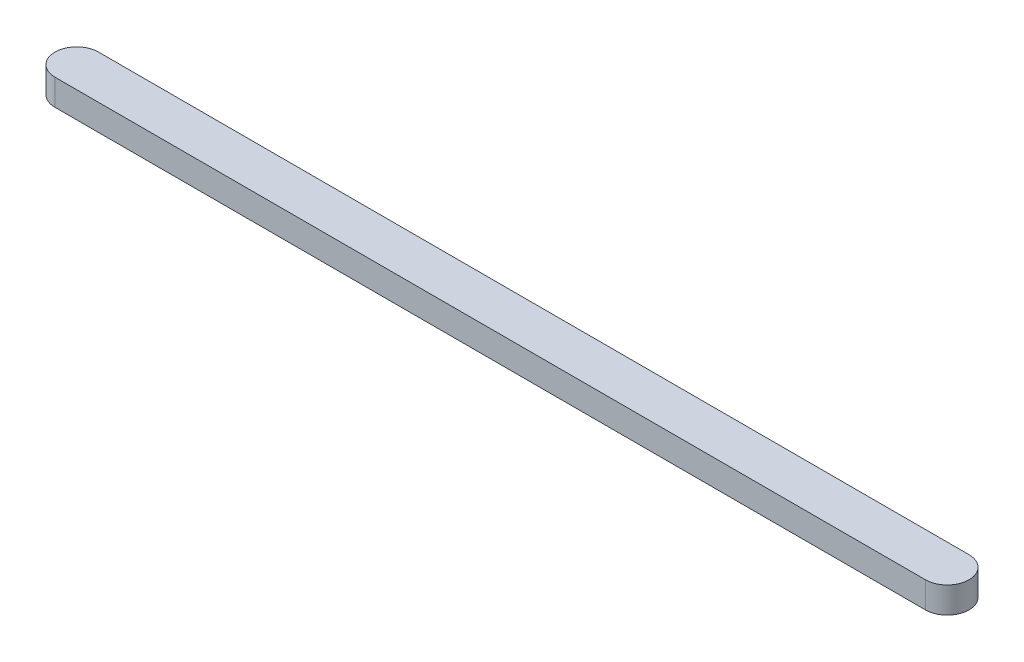
ISO-10303-21;
HEADER;
FILE_DESCRIPTION(('STEP AP214'),'2;1');
FILE_NAME('part.step','',(''),(''),'','','');
FILE_SCHEMA(('AUTOMOTIVE_DESIGN { 1 0 10303 214 1 1 1 1 }'));
ENDSEC;
DATA;
#1=APPLICATION_CONTEXT('core data for automotive mechanical design processes');
#2=APPLICATION_PROTOCOL_DEFINITION('international standard','automotive_design',2000,#1);
#3=PRODUCT_CONTEXT('',#1,'mechanical');
#4=PRODUCT('Part','Part','',(#3));
#5=PRODUCT_RELATED_PRODUCT_CATEGORY('part','',(#4));
#6=PRODUCT_DEFINITION_FORMATION('','',#4);
#7=PRODUCT_DEFINITION_CONTEXT('part definition',#1,'design');
#8=PRODUCT_DEFINITION('design','',#6,#7);
#9=PRODUCT_DEFINITION_SHAPE('','',#8);
#10=(LENGTH_UNIT() NAMED_UNIT(*) SI_UNIT(.MILLI.,.METRE.));
#11=(NAMED_UNIT(*) PLANE_ANGLE_UNIT() SI_UNIT($,.RADIAN.));
#12=(NAMED_UNIT(*) SI_UNIT($,.STERADIAN.) SOLID_ANGLE_UNIT());
#13=UNCERTAINTY_MEASURE_WITH_UNIT(LENGTH_MEASURE(1.E-05),#10,'distance_accuracy_value','');
#14=(GEOMETRIC_REPRESENTATION_CONTEXT(3) GLOBAL_UNCERTAINTY_ASSIGNED_CONTEXT((#13)) GLOBAL_UNIT_ASSIGNED_CONTEXT((#10,
#11,#12)) REPRESENTATION_CONTEXT('',''));
#15=CARTESIAN_POINT('',(0.,0.,0.));
#16=DIRECTION('',(0.,0.,1.));
#17=DIRECTION('',(1.,0.,0.));
#18=AXIS2_PLACEMENT_3D('',#15,#16,#17);
#19=CARTESIAN_POINT('',(0.,6.,0.));
#20=DIRECTION('',(0.,-1.,0.));
#21=DIRECTION('',(0.,0.,-1.));
#22=AXIS2_PLACEMENT_3D('',#19,#20,#21);
#23=CYLINDRICAL_SURFACE('',#22,5.);
#24=CARTESIAN_POINT('',(0.,0.,0.));
#25=DIRECTION('',(0.,1.,0.));
#26=DIRECTION('',(0.,0.,1.));
#27=AXIS2_PLACEMENT_3D('',#24,#25,#26);
#28=CIRCLE('',#27,5.);
#29=CARTESIAN_POINT('',(0.,0.,-5.));
#30=VERTEX_POINT('',#29);
#31=CARTESIAN_POINT('',(0.,0.,5.));
#32=VERTEX_POINT('',#31);
#33=EDGE_CURVE('E107',#30,#32,#28,.T.);
#34=ORIENTED_EDGE('',*,*,#33,.T.);
#35=DIRECTION('',(0.,-1.,0.));
#36=VECTOR('',#35,1.);
#37=CARTESIAN_POINT('',(0.,6.,5.));
#38=LINE('',#37,#36);
#39=CARTESIAN_POINT('',(0.,6.,5.));
#40=VERTEX_POINT('',#39);
#41=EDGE_CURVE('E11',#40,#32,#38,.T.);
#42=ORIENTED_EDGE('',*,*,#41,.F.);
#43=CARTESIAN_POINT('',(0.,6.,0.));
#44=DIRECTION('',(0.,1.,0.));
#45=DIRECTION('',(0.,0.,1.));
#46=AXIS2_PLACEMENT_3D('',#43,#44,#45);
#47=CIRCLE('',#46,5.);
#48=CARTESIAN_POINT('',(0.,6.,-5.));
#49=VERTEX_POINT('',#48);
#50=EDGE_CURVE('E91',#49,#40,#47,.T.);
#51=ORIENTED_EDGE('',*,*,#50,.F.);
#52=DIRECTION('',(0.,-1.,0.));
#53=VECTOR('',#52,1.);
#54=CARTESIAN_POINT('',(0.,6.,-5.));
#55=LINE('',#54,#53);
#56=EDGE_CURVE('E103',#49,#30,#55,.T.);
#57=ORIENTED_EDGE('',*,*,#56,.T.);
#58=EDGE_LOOP('',(#34,#42,#51,#57));
#59=FACE_BOUND('',#58,.T.);
#60=ADVANCED_FACE('F39',(#59),#23,.T.);
#61=CARTESIAN_POINT('',(0.,6.,5.));
#62=DIRECTION('',(0.,0.,-1.));
#63=DIRECTION('',(-1.,0.,0.));
#64=AXIS2_PLACEMENT_3D('',#61,#62,#63);
#65=PLANE('',#64);
#66=DIRECTION('',(1.,0.,0.));
#67=VECTOR('',#66,1.);
#68=CARTESIAN_POINT('',(0.,0.,5.));
#69=LINE('',#68,#67);
#70=CARTESIAN_POINT('',(200.,0.,5.));
#71=VERTEX_POINT('',#70);
#72=EDGE_CURVE('E96',#32,#71,#69,.T.);
#73=ORIENTED_EDGE('',*,*,#72,.T.);
#74=DIRECTION('',(0.,-1.,0.));
#75=VECTOR('',#74,1.);
#76=CARTESIAN_POINT('',(200.,6.,5.));
#77=LINE('',#76,#75);
#78=CARTESIAN_POINT('',(200.,6.,5.));
#79=VERTEX_POINT('',#78);
#80=EDGE_CURVE('E48',#79,#71,#77,.T.);
#81=ORIENTED_EDGE('',*,*,#80,.F.);
#82=DIRECTION('',(1.,0.,0.));
#83=VECTOR('',#82,1.);
#84=CARTESIAN_POINT('',(0.,6.,5.));
#85=LINE('',#84,#83);
#86=EDGE_CURVE('E86',#40,#79,#85,.T.);
#87=ORIENTED_EDGE('',*,*,#86,.F.);
#88=ORIENTED_EDGE('',*,*,#41,.T.);
#89=EDGE_LOOP('',(#73,#81,#87,#88));
#90=FACE_BOUND('',#89,.T.);
#91=ADVANCED_FACE('F95',(#90),#65,.F.);
#92=CARTESIAN_POINT('',(200.,6.,0.));
#93=DIRECTION('',(0.,-1.,0.));
#94=DIRECTION('',(0.,0.,-1.));
#95=AXIS2_PLACEMENT_3D('',#92,#93,#94);
#96=CYLINDRICAL_SURFACE('',#95,5.);
#97=CARTESIAN_POINT('',(200.,0.,0.));
#98=DIRECTION('',(0.,1.,0.));
#99=DIRECTION('',(0.,0.,1.));
#100=AXIS2_PLACEMENT_3D('',#97,#98,#99);
#101=CIRCLE('',#100,5.);
#102=CARTESIAN_POINT('',(200.,0.,-5.));
#103=VERTEX_POINT('',#102);
#104=EDGE_CURVE('E73',#71,#103,#101,.T.);
#105=ORIENTED_EDGE('',*,*,#104,.T.);
#106=DIRECTION('',(0.,-1.,0.));
#107=VECTOR('',#106,1.);
#108=CARTESIAN_POINT('',(200.,6.,-5.));
#109=LINE('',#108,#107);
#110=CARTESIAN_POINT('',(200.,6.,-5.));
#111=VERTEX_POINT('',#110);
#112=EDGE_CURVE('E98',#111,#103,#109,.T.);
#113=ORIENTED_EDGE('',*,*,#112,.F.);
#114=CARTESIAN_POINT('',(200.,6.,0.));
#115=DIRECTION('',(0.,1.,0.));
#116=DIRECTION('',(0.,0.,1.));
#117=AXIS2_PLACEMENT_3D('',#114,#115,#116);
#118=CIRCLE('',#117,5.);
#119=EDGE_CURVE('E89',#79,#111,#118,.T.);
#120=ORIENTED_EDGE('',*,*,#119,.F.);
#121=ORIENTED_EDGE('',*,*,#80,.T.);
#122=EDGE_LOOP('',(#105,#113,#120,#121));
#123=FACE_BOUND('',#122,.T.);
#124=ADVANCED_FACE('F99',(#123),#96,.T.);
#125=CARTESIAN_POINT('',(0.,6.,-5.));
#126=DIRECTION('',(0.,0.,1.));
#127=DIRECTION('',(1.,0.,0.));
#128=AXIS2_PLACEMENT_3D('',#125,#126,#127);
#129=PLANE('',#128);
#130=DIRECTION('',(-1.,0.,0.));
#131=VECTOR('',#130,1.);
#132=CARTESIAN_POINT('',(0.,0.,-5.));
#133=LINE('',#132,#131);
#134=EDGE_CURVE('E79',#103,#30,#133,.T.);
#135=ORIENTED_EDGE('',*,*,#134,.T.);
#136=ORIENTED_EDGE('',*,*,#56,.F.);
#137=DIRECTION('',(-1.,0.,0.));
#138=VECTOR('',#137,1.);
#139=CARTESIAN_POINT('',(0.,6.,-5.));
#140=LINE('',#139,#138);
#141=EDGE_CURVE('E56',#111,#49,#140,.T.);
#142=ORIENTED_EDGE('',*,*,#141,.F.);
#143=ORIENTED_EDGE('',*,*,#112,.T.);
#144=EDGE_LOOP('',(#135,#136,#142,#143));
#145=FACE_BOUND('',#144,.T.);
#146=ADVANCED_FACE('F120',(#145),#129,.F.);
#147=CARTESIAN_POINT('',(0.,6.,0.));
#148=DIRECTION('',(0.,1.,0.));
#149=DIRECTION('',(0.,0.,1.));
#150=AXIS2_PLACEMENT_3D('',#147,#148,#149);
#151=PLANE('',#150);
#152=ORIENTED_EDGE('',*,*,#50,.T.);
#153=ORIENTED_EDGE('',*,*,#86,.T.);
#154=ORIENTED_EDGE('',*,*,#119,.T.);
#155=ORIENTED_EDGE('',*,*,#141,.T.);
#156=EDGE_LOOP('',(#152,#153,#154,#155));
#157=FACE_BOUND('',#156,.T.);
#158=ADVANCED_FACE('F87',(#157),#151,.T.);
#159=CARTESIAN_POINT('',(0.,0.,0.));
#160=DIRECTION('',(0.,1.,0.));
#161=DIRECTION('',(0.,0.,1.));
#162=AXIS2_PLACEMENT_3D('',#159,#160,#161);
#163=PLANE('',#162);
#164=ORIENTED_EDGE('',*,*,#33,.F.);
#165=ORIENTED_EDGE('',*,*,#134,.F.);
#166=ORIENTED_EDGE('',*,*,#104,.F.);
#167=ORIENTED_EDGE('',*,*,#72,.F.);
#168=EDGE_LOOP('',(#164,#165,#166,#167));
#169=FACE_BOUND('',#168,.T.);
#170=ADVANCED_FACE('F123',(#169),#163,.F.);
#171=CLOSED_SHELL('',(#60,#91,#124,#146,#158,#170));
#172=MANIFOLD_SOLID_BREP('B2',#171);
#173=ADVANCED_BREP_SHAPE_REPRESENTATION('',(#18,#172),#14);
#174=SHAPE_DEFINITION_REPRESENTATION(#9,#173);
ENDSEC;
END-ISO-10303-21;
